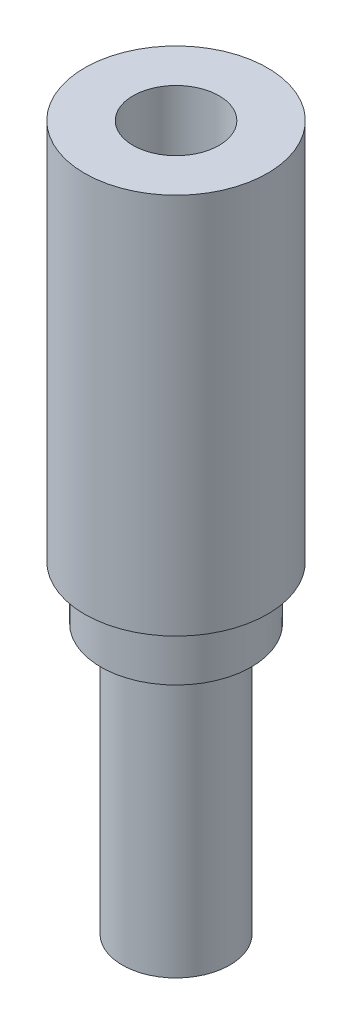
ISO-10303-21;
HEADER;
FILE_DESCRIPTION(('STEP AP214'),'2;1');
FILE_NAME('part.step','',(''),(''),'','','');
FILE_SCHEMA(('AUTOMOTIVE_DESIGN { 1 0 10303 214 1 1 1 1 }'));
ENDSEC;
DATA;
#1=APPLICATION_CONTEXT('core data for automotive mechanical design processes');
#2=APPLICATION_PROTOCOL_DEFINITION('international standard','automotive_design',2000,#1);
#3=PRODUCT_CONTEXT('',#1,'mechanical');
#4=PRODUCT('Part','Part','',(#3));
#5=PRODUCT_RELATED_PRODUCT_CATEGORY('part','',(#4));
#6=PRODUCT_DEFINITION_FORMATION('','',#4);
#7=PRODUCT_DEFINITION_CONTEXT('part definition',#1,'design');
#8=PRODUCT_DEFINITION('design','',#6,#7);
#9=PRODUCT_DEFINITION_SHAPE('','',#8);
#10=(LENGTH_UNIT() NAMED_UNIT(*) SI_UNIT(.MILLI.,.METRE.));
#11=(NAMED_UNIT(*) PLANE_ANGLE_UNIT() SI_UNIT($,.RADIAN.));
#12=(NAMED_UNIT(*) SI_UNIT($,.STERADIAN.) SOLID_ANGLE_UNIT());
#13=UNCERTAINTY_MEASURE_WITH_UNIT(LENGTH_MEASURE(1.E-05),#10,'distance_accuracy_value','');
#14=(GEOMETRIC_REPRESENTATION_CONTEXT(3) GLOBAL_UNCERTAINTY_ASSIGNED_CONTEXT((#13)) GLOBAL_UNIT_ASSIGNED_CONTEXT((#10,
#11,#12)) REPRESENTATION_CONTEXT('',''));
#15=CARTESIAN_POINT('',(0.,0.,0.));
#16=DIRECTION('',(0.,0.,1.));
#17=DIRECTION('',(1.,0.,0.));
#18=AXIS2_PLACEMENT_3D('',#15,#16,#17);
#19=CARTESIAN_POINT('',(0.,35.5,0.));
#20=DIRECTION('',(0.,-1.,0.));
#21=DIRECTION('',(0.,0.,-1.));
#22=AXIS2_PLACEMENT_3D('',#19,#20,#21);
#23=CYLINDRICAL_SURFACE('',#22,8.5);
#24=CARTESIAN_POINT('',(0.,35.5,0.));
#25=DIRECTION('',(0.,1.,0.));
#26=DIRECTION('',(0.,0.,1.));
#27=AXIS2_PLACEMENT_3D('',#24,#25,#26);
#28=CIRCLE('',#27,8.5);
#29=CARTESIAN_POINT('',(0.,35.5,8.5));
#30=VERTEX_POINT('',#29);
#31=EDGE_CURVE('E44',#30,#30,#28,.T.);
#32=ORIENTED_EDGE('',*,*,#31,.F.);
#33=EDGE_LOOP('',(#32));
#34=FACE_BOUND('',#33,.T.);
#35=CARTESIAN_POINT('',(0.,0.,0.));
#36=DIRECTION('',(0.,1.,0.));
#37=DIRECTION('',(0.,0.,1.));
#38=AXIS2_PLACEMENT_3D('',#35,#36,#37);
#39=CIRCLE('',#38,8.5);
#40=CARTESIAN_POINT('',(0.,0.,8.5));
#41=VERTEX_POINT('',#40);
#42=EDGE_CURVE('E35',#41,#41,#39,.T.);
#43=ORIENTED_EDGE('',*,*,#42,.T.);
#44=EDGE_LOOP('',(#43));
#45=FACE_BOUND('',#44,.T.);
#46=ADVANCED_FACE('F32',(#34,#45),#23,.T.);
#47=CARTESIAN_POINT('',(0.,35.5,0.));
#48=DIRECTION('',(0.,1.,0.));
#49=DIRECTION('',(0.,0.,1.));
#50=AXIS2_PLACEMENT_3D('',#47,#48,#49);
#51=PLANE('',#50);
#52=CARTESIAN_POINT('',(0.,35.5,0.));
#53=DIRECTION('',(0.,1.,0.));
#54=DIRECTION('',(0.,0.,1.));
#55=AXIS2_PLACEMENT_3D('',#52,#53,#54);
#56=CIRCLE('',#55,4.);
#57=CARTESIAN_POINT('',(0.,35.5,4.));
#58=VERTEX_POINT('',#57);
#59=EDGE_CURVE('E152',#58,#58,#56,.T.);
#60=ORIENTED_EDGE('',*,*,#59,.F.);
#61=EDGE_LOOP('',(#60));
#62=FACE_BOUND('',#61,.T.);
#63=ORIENTED_EDGE('',*,*,#31,.T.);
#64=EDGE_LOOP('',(#63));
#65=FACE_BOUND('',#64,.T.);
#66=ADVANCED_FACE('F62',(#62,#65),#51,.T.);
#67=CARTESIAN_POINT('',(0.,0.,0.));
#68=DIRECTION('',(0.,1.,0.));
#69=DIRECTION('',(0.,0.,1.));
#70=AXIS2_PLACEMENT_3D('',#67,#68,#69);
#71=PLANE('',#70);
#72=CARTESIAN_POINT('',(0.,0.,0.));
#73=DIRECTION('',(0.,-1.,0.));
#74=DIRECTION('',(0.,0.,-1.));
#75=AXIS2_PLACEMENT_3D('',#72,#73,#74);
#76=CIRCLE('',#75,7.);
#77=CARTESIAN_POINT('',(0.,0.,-7.));
#78=VERTEX_POINT('',#77);
#79=EDGE_CURVE('E39',#78,#78,#76,.T.);
#80=ORIENTED_EDGE('',*,*,#79,.F.);
#81=EDGE_LOOP('',(#80));
#82=FACE_BOUND('',#81,.T.);
#83=ORIENTED_EDGE('',*,*,#42,.F.);
#84=EDGE_LOOP('',(#83));
#85=FACE_BOUND('',#84,.T.);
#86=ADVANCED_FACE('F59',(#82,#85),#71,.F.);
#87=CARTESIAN_POINT('',(0.,-5.,0.));
#88=DIRECTION('',(0.,1.,0.));
#89=DIRECTION('',(0.,0.,1.));
#90=AXIS2_PLACEMENT_3D('',#87,#88,#89);
#91=CYLINDRICAL_SURFACE('',#90,7.);
#92=CARTESIAN_POINT('',(0.,-5.,0.));
#93=DIRECTION('',(0.,-1.,0.));
#94=DIRECTION('',(0.,0.,-1.));
#95=AXIS2_PLACEMENT_3D('',#92,#93,#94);
#96=CIRCLE('',#95,7.);
#97=CARTESIAN_POINT('',(0.,-5.,-7.));
#98=VERTEX_POINT('',#97);
#99=EDGE_CURVE('E50',#98,#98,#96,.T.);
#100=ORIENTED_EDGE('',*,*,#99,.F.);
#101=EDGE_LOOP('',(#100));
#102=FACE_BOUND('',#101,.T.);
#103=ORIENTED_EDGE('',*,*,#79,.T.);
#104=EDGE_LOOP('',(#103));
#105=FACE_BOUND('',#104,.T.);
#106=ADVANCED_FACE('F61',(#102,#105),#91,.T.);
#107=CARTESIAN_POINT('',(0.,-5.,0.));
#108=DIRECTION('',(0.,-1.,0.));
#109=DIRECTION('',(0.,0.,-1.));
#110=AXIS2_PLACEMENT_3D('',#107,#108,#109);
#111=PLANE('',#110);
#112=CARTESIAN_POINT('',(0.,-5.,0.));
#113=DIRECTION('',(0.,-1.,0.));
#114=DIRECTION('',(0.,0.,-1.));
#115=AXIS2_PLACEMENT_3D('',#112,#113,#114);
#116=CIRCLE('',#115,5.);
#117=CARTESIAN_POINT('',(0.,-5.,-5.));
#118=VERTEX_POINT('',#117);
#119=EDGE_CURVE('E10',#118,#118,#116,.T.);
#120=ORIENTED_EDGE('',*,*,#119,.F.);
#121=EDGE_LOOP('',(#120));
#122=FACE_BOUND('',#121,.T.);
#123=ORIENTED_EDGE('',*,*,#99,.T.);
#124=EDGE_LOOP('',(#123));
#125=FACE_BOUND('',#124,.T.);
#126=ADVANCED_FACE('F68',(#122,#125),#111,.T.);
#127=CARTESIAN_POINT('',(0.,-30.,0.));
#128=DIRECTION('',(0.,1.,0.));
#129=DIRECTION('',(0.,0.,1.));
#130=AXIS2_PLACEMENT_3D('',#127,#128,#129);
#131=CYLINDRICAL_SURFACE('',#130,5.);
#132=CARTESIAN_POINT('',(0.,-30.,0.));
#133=DIRECTION('',(0.,-1.,0.));
#134=DIRECTION('',(0.,0.,-1.));
#135=AXIS2_PLACEMENT_3D('',#132,#133,#134);
#136=CIRCLE('',#135,5.);
#137=CARTESIAN_POINT('',(0.,-30.,-5.));
#138=VERTEX_POINT('',#137);
#139=EDGE_CURVE('E48',#138,#138,#136,.T.);
#140=ORIENTED_EDGE('',*,*,#139,.F.);
#141=EDGE_LOOP('',(#140));
#142=FACE_BOUND('',#141,.T.);
#143=ORIENTED_EDGE('',*,*,#119,.T.);
#144=EDGE_LOOP('',(#143));
#145=FACE_BOUND('',#144,.T.);
#146=ADVANCED_FACE('F116',(#142,#145),#131,.T.);
#147=CARTESIAN_POINT('',(0.,-30.,0.));
#148=DIRECTION('',(0.,-1.,0.));
#149=DIRECTION('',(0.,0.,-1.));
#150=AXIS2_PLACEMENT_3D('',#147,#148,#149);
#151=PLANE('',#150);
#152=ORIENTED_EDGE('',*,*,#139,.T.);
#153=EDGE_LOOP('',(#152));
#154=FACE_BOUND('',#153,.T.);
#155=ADVANCED_FACE('F89',(#154),#151,.T.);
#156=CARTESIAN_POINT('',(0.,18.5,0.));
#157=DIRECTION('',(0.,1.,0.));
#158=DIRECTION('',(0.,0.,1.));
#159=AXIS2_PLACEMENT_3D('',#156,#157,#158);
#160=CYLINDRICAL_SURFACE('',#159,4.);
#161=CARTESIAN_POINT('',(0.,18.5,0.));
#162=DIRECTION('',(0.,1.,0.));
#163=DIRECTION('',(0.,0.,1.));
#164=AXIS2_PLACEMENT_3D('',#161,#162,#163);
#165=CIRCLE('',#164,4.);
#166=CARTESIAN_POINT('',(0.,18.5,4.));
#167=VERTEX_POINT('',#166);
#168=EDGE_CURVE('E151',#167,#167,#165,.T.);
#169=ORIENTED_EDGE('',*,*,#168,.F.);
#170=EDGE_LOOP('',(#169));
#171=FACE_BOUND('',#170,.T.);
#172=ORIENTED_EDGE('',*,*,#59,.T.);
#173=EDGE_LOOP('',(#172));
#174=FACE_BOUND('',#173,.T.);
#175=ADVANCED_FACE('F94',(#171,#174),#160,.F.);
#176=CARTESIAN_POINT('',(0.,18.5,0.));
#177=DIRECTION('',(0.,1.,0.));
#178=DIRECTION('',(0.,0.,1.));
#179=AXIS2_PLACEMENT_3D('',#176,#177,#178);
#180=PLANE('',#179);
#181=ORIENTED_EDGE('',*,*,#168,.T.);
#182=EDGE_LOOP('',(#181));
#183=FACE_BOUND('',#182,.T.);
#184=ADVANCED_FACE('F99',(#183),#180,.T.);
#185=CLOSED_SHELL('',(#46,#66,#86,#106,#126,#146,#155,#175,#184));
#186=MANIFOLD_SOLID_BREP('B2',#185);
#187=ADVANCED_BREP_SHAPE_REPRESENTATION('',(#18,#186),#14);
#188=SHAPE_DEFINITION_REPRESENTATION(#9,#187);
ENDSEC;
END-ISO-10303-21;
